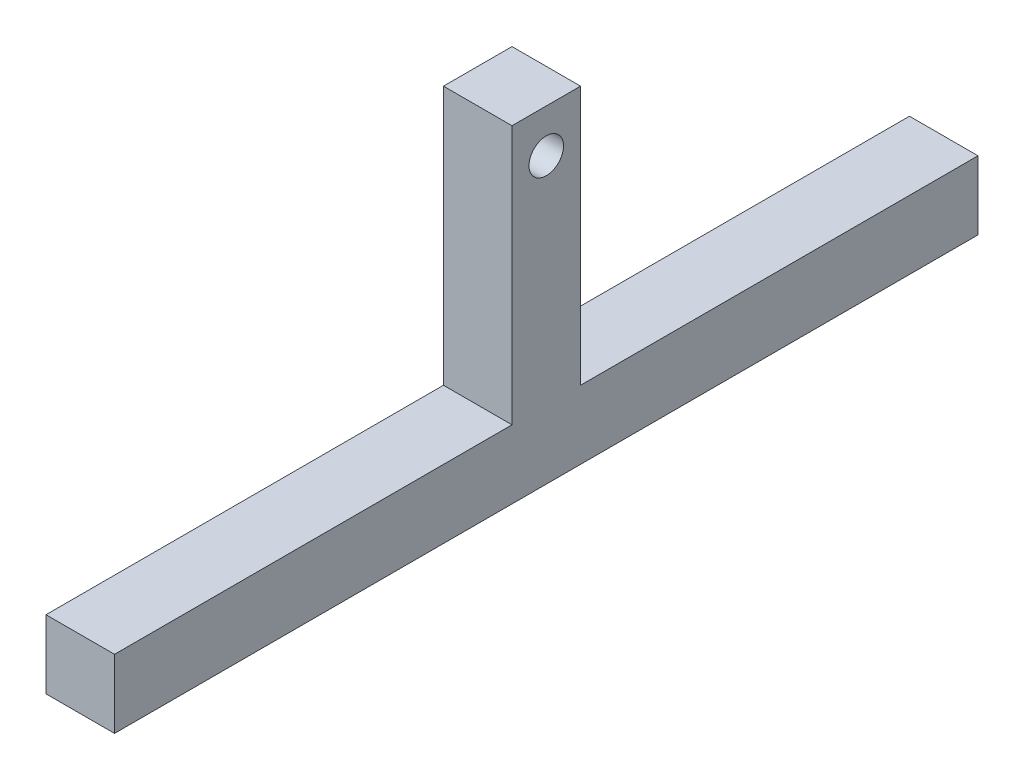
ISO-10303-21;
HEADER;
FILE_DESCRIPTION(('STEP AP214'),'2;1');
FILE_NAME('part.step','',(''),(''),'','','');
FILE_SCHEMA(('AUTOMOTIVE_DESIGN { 1 0 10303 214 1 1 1 1 }'));
ENDSEC;
DATA;
#1=APPLICATION_CONTEXT('core data for automotive mechanical design processes');
#2=APPLICATION_PROTOCOL_DEFINITION('international standard','automotive_design',2000,#1);
#3=PRODUCT_CONTEXT('',#1,'mechanical');
#4=PRODUCT('Part','Part','',(#3));
#5=PRODUCT_RELATED_PRODUCT_CATEGORY('part','',(#4));
#6=PRODUCT_DEFINITION_FORMATION('','',#4);
#7=PRODUCT_DEFINITION_CONTEXT('part definition',#1,'design');
#8=PRODUCT_DEFINITION('design','',#6,#7);
#9=PRODUCT_DEFINITION_SHAPE('','',#8);
#10=(LENGTH_UNIT() NAMED_UNIT(*) SI_UNIT(.MILLI.,.METRE.));
#11=(NAMED_UNIT(*) PLANE_ANGLE_UNIT() SI_UNIT($,.RADIAN.));
#12=(NAMED_UNIT(*) SI_UNIT($,.STERADIAN.) SOLID_ANGLE_UNIT());
#13=UNCERTAINTY_MEASURE_WITH_UNIT(LENGTH_MEASURE(1.E-05),#10,'distance_accuracy_value','');
#14=(GEOMETRIC_REPRESENTATION_CONTEXT(3) GLOBAL_UNCERTAINTY_ASSIGNED_CONTEXT((#13)) GLOBAL_UNIT_ASSIGNED_CONTEXT((#10,
#11,#12)) REPRESENTATION_CONTEXT('',''));
#15=CARTESIAN_POINT('',(0.,0.,0.));
#16=DIRECTION('',(0.,0.,1.));
#17=DIRECTION('',(1.,0.,0.));
#18=AXIS2_PLACEMENT_3D('',#15,#16,#17);
#19=CARTESIAN_POINT('',(15.875,0.,-100.));
#20=DIRECTION('',(0.,0.,-1.));
#21=DIRECTION('',(-1.,0.,0.));
#22=AXIS2_PLACEMENT_3D('',#19,#20,#21);
#23=PLANE('',#22);
#24=DIRECTION('',(0.,-1.,0.));
#25=VECTOR('',#24,1.);
#26=CARTESIAN_POINT('',(0.,0.,-100.));
#27=LINE('',#26,#25);
#28=CARTESIAN_POINT('',(0.,7.9375,-100.));
#29=VERTEX_POINT('',#28);
#30=CARTESIAN_POINT('',(0.,-7.9375,-100.));
#31=VERTEX_POINT('',#30);
#32=EDGE_CURVE('E159',#29,#31,#27,.T.);
#33=ORIENTED_EDGE('',*,*,#32,.F.);
#34=DIRECTION('',(-1.,0.,0.));
#35=VECTOR('',#34,1.);
#36=CARTESIAN_POINT('',(15.875,7.9375,-100.));
#37=LINE('',#36,#35);
#38=CARTESIAN_POINT('',(15.875,7.9375,-100.));
#39=VERTEX_POINT('',#38);
#40=EDGE_CURVE('E11',#39,#29,#37,.T.);
#41=ORIENTED_EDGE('',*,*,#40,.F.);
#42=DIRECTION('',(0.,-1.,0.));
#43=VECTOR('',#42,1.);
#44=CARTESIAN_POINT('',(15.875,0.,-100.));
#45=LINE('',#44,#43);
#46=CARTESIAN_POINT('',(15.875,-7.9375,-100.));
#47=VERTEX_POINT('',#46);
#48=EDGE_CURVE('E143',#39,#47,#45,.T.);
#49=ORIENTED_EDGE('',*,*,#48,.T.);
#50=DIRECTION('',(-1.,0.,0.));
#51=VECTOR('',#50,1.);
#52=CARTESIAN_POINT('',(15.875,-7.9375,-100.));
#53=LINE('',#52,#51);
#54=EDGE_CURVE('E92',#47,#31,#53,.T.);
#55=ORIENTED_EDGE('',*,*,#54,.T.);
#56=EDGE_LOOP('',(#33,#41,#49,#55));
#57=FACE_BOUND('',#56,.T.);
#58=ADVANCED_FACE('F41',(#57),#23,.T.);
#59=CARTESIAN_POINT('',(15.875,7.9375,0.));
#60=DIRECTION('',(0.,1.,0.));
#61=DIRECTION('',(0.,0.,1.));
#62=AXIS2_PLACEMENT_3D('',#59,#60,#61);
#63=PLANE('',#62);
#64=DIRECTION('',(0.,0.,-1.));
#65=VECTOR('',#64,1.);
#66=CARTESIAN_POINT('',(0.,7.9375,0.));
#67=LINE('',#66,#65);
#68=CARTESIAN_POINT('',(0.,7.9375,-7.9375));
#69=VERTEX_POINT('',#68);
#70=EDGE_CURVE('E164',#69,#29,#67,.T.);
#71=ORIENTED_EDGE('',*,*,#70,.F.);
#72=DIRECTION('',(-1.,0.,0.));
#73=VECTOR('',#72,1.);
#74=CARTESIAN_POINT('',(15.875,7.9375,-7.9375));
#75=LINE('',#74,#73);
#76=CARTESIAN_POINT('',(15.875,7.9375,-7.9375));
#77=VERTEX_POINT('',#76);
#78=EDGE_CURVE('E50',#77,#69,#75,.T.);
#79=ORIENTED_EDGE('',*,*,#78,.F.);
#80=DIRECTION('',(0.,0.,-1.));
#81=VECTOR('',#80,1.);
#82=CARTESIAN_POINT('',(15.875,7.9375,0.));
#83=LINE('',#82,#81);
#84=EDGE_CURVE('E134',#77,#39,#83,.T.);
#85=ORIENTED_EDGE('',*,*,#84,.T.);
#86=ORIENTED_EDGE('',*,*,#40,.T.);
#87=EDGE_LOOP('',(#71,#79,#85,#86));
#88=FACE_BOUND('',#87,.T.);
#89=ADVANCED_FACE('F207',(#88),#63,.T.);
#90=CARTESIAN_POINT('',(15.875,0.,-7.9375));
#91=DIRECTION('',(0.,0.,1.));
#92=DIRECTION('',(1.,0.,0.));
#93=AXIS2_PLACEMENT_3D('',#90,#91,#92);
#94=PLANE('',#93);
#95=DIRECTION('',(0.,1.,0.));
#96=VECTOR('',#95,1.);
#97=CARTESIAN_POINT('',(0.,0.,-7.9375));
#98=LINE('',#97,#96);
#99=CARTESIAN_POINT('',(0.,67.9375,-7.9375));
#100=VERTEX_POINT('',#99);
#101=EDGE_CURVE('E170',#69,#100,#98,.T.);
#102=ORIENTED_EDGE('',*,*,#101,.T.);
#103=DIRECTION('',(-1.,0.,0.));
#104=VECTOR('',#103,1.);
#105=CARTESIAN_POINT('',(15.875,67.9375,-7.9375));
#106=LINE('',#105,#104);
#107=CARTESIAN_POINT('',(15.875,67.9375,-7.9375));
#108=VERTEX_POINT('',#107);
#109=EDGE_CURVE('E196',#108,#100,#106,.T.);
#110=ORIENTED_EDGE('',*,*,#109,.F.);
#111=DIRECTION('',(0.,1.,0.));
#112=VECTOR('',#111,1.);
#113=CARTESIAN_POINT('',(15.875,0.,-7.9375));
#114=LINE('',#113,#112);
#115=EDGE_CURVE('E142',#77,#108,#114,.T.);
#116=ORIENTED_EDGE('',*,*,#115,.F.);
#117=ORIENTED_EDGE('',*,*,#78,.T.);
#118=EDGE_LOOP('',(#102,#110,#116,#117));
#119=FACE_BOUND('',#118,.T.);
#120=ADVANCED_FACE('F202',(#119),#94,.F.);
#121=CARTESIAN_POINT('',(15.875,67.9375,0.));
#122=DIRECTION('',(0.,1.,0.));
#123=DIRECTION('',(0.,0.,1.));
#124=AXIS2_PLACEMENT_3D('',#121,#122,#123);
#125=PLANE('',#124);
#126=DIRECTION('',(0.,0.,-1.));
#127=VECTOR('',#126,1.);
#128=CARTESIAN_POINT('',(0.,67.9375,0.));
#129=LINE('',#128,#127);
#130=CARTESIAN_POINT('',(0.,67.9375,7.9375));
#131=VERTEX_POINT('',#130);
#132=EDGE_CURVE('E177',#131,#100,#129,.T.);
#133=ORIENTED_EDGE('',*,*,#132,.F.);
#134=DIRECTION('',(-1.,0.,0.));
#135=VECTOR('',#134,1.);
#136=CARTESIAN_POINT('',(15.875,67.9375,7.9375));
#137=LINE('',#136,#135);
#138=CARTESIAN_POINT('',(15.875,67.9375,7.9375));
#139=VERTEX_POINT('',#138);
#140=EDGE_CURVE('E193',#139,#131,#137,.T.);
#141=ORIENTED_EDGE('',*,*,#140,.F.);
#142=DIRECTION('',(0.,0.,-1.));
#143=VECTOR('',#142,1.);
#144=CARTESIAN_POINT('',(15.875,67.9375,0.));
#145=LINE('',#144,#143);
#146=EDGE_CURVE('E136',#139,#108,#145,.T.);
#147=ORIENTED_EDGE('',*,*,#146,.T.);
#148=ORIENTED_EDGE('',*,*,#109,.T.);
#149=EDGE_LOOP('',(#133,#141,#147,#148));
#150=FACE_BOUND('',#149,.T.);
#151=ADVANCED_FACE('F216',(#150),#125,.T.);
#152=CARTESIAN_POINT('',(15.875,0.,7.9375));
#153=DIRECTION('',(0.,0.,1.));
#154=DIRECTION('',(1.,0.,0.));
#155=AXIS2_PLACEMENT_3D('',#152,#153,#154);
#156=PLANE('',#155);
#157=DIRECTION('',(0.,1.,0.));
#158=VECTOR('',#157,1.);
#159=CARTESIAN_POINT('',(0.,0.,7.9375));
#160=LINE('',#159,#158);
#161=CARTESIAN_POINT('',(0.,7.9375,7.9375));
#162=VERTEX_POINT('',#161);
#163=EDGE_CURVE('E181',#162,#131,#160,.T.);
#164=ORIENTED_EDGE('',*,*,#163,.F.);
#165=DIRECTION('',(-1.,0.,0.));
#166=VECTOR('',#165,1.);
#167=CARTESIAN_POINT('',(15.875,7.9375,7.9375));
#168=LINE('',#167,#166);
#169=CARTESIAN_POINT('',(15.875,7.9375,7.9375));
#170=VERTEX_POINT('',#169);
#171=EDGE_CURVE('E120',#170,#162,#168,.T.);
#172=ORIENTED_EDGE('',*,*,#171,.F.);
#173=DIRECTION('',(0.,1.,0.));
#174=VECTOR('',#173,1.);
#175=CARTESIAN_POINT('',(15.875,0.,7.9375));
#176=LINE('',#175,#174);
#177=EDGE_CURVE('E131',#170,#139,#176,.T.);
#178=ORIENTED_EDGE('',*,*,#177,.T.);
#179=ORIENTED_EDGE('',*,*,#140,.T.);
#180=EDGE_LOOP('',(#164,#172,#178,#179));
#181=FACE_BOUND('',#180,.T.);
#182=ADVANCED_FACE('F220',(#181),#156,.T.);
#183=CARTESIAN_POINT('',(0.,7.9375,100.));
#184=VERTEX_POINT('',#183);
#185=EDGE_CURVE('E118',#184,#162,#67,.T.);
#186=ORIENTED_EDGE('',*,*,#185,.F.);
#187=DIRECTION('',(-1.,0.,0.));
#188=VECTOR('',#187,1.);
#189=CARTESIAN_POINT('',(15.875,7.9375,100.));
#190=LINE('',#189,#188);
#191=CARTESIAN_POINT('',(15.875,7.9375,100.));
#192=VERTEX_POINT('',#191);
#193=EDGE_CURVE('E112',#192,#184,#190,.T.);
#194=ORIENTED_EDGE('',*,*,#193,.F.);
#195=EDGE_CURVE('E116',#192,#170,#83,.T.);
#196=ORIENTED_EDGE('',*,*,#195,.T.);
#197=ORIENTED_EDGE('',*,*,#171,.T.);
#198=EDGE_LOOP('',(#186,#194,#196,#197));
#199=FACE_BOUND('',#198,.T.);
#200=ADVANCED_FACE('F114',(#199),#63,.T.);
#201=CARTESIAN_POINT('',(15.875,0.,100.));
#202=DIRECTION('',(0.,0.,-1.));
#203=DIRECTION('',(-1.,0.,0.));
#204=AXIS2_PLACEMENT_3D('',#201,#202,#203);
#205=PLANE('',#204);
#206=DIRECTION('',(0.,-1.,0.));
#207=VECTOR('',#206,1.);
#208=CARTESIAN_POINT('',(0.,0.,100.));
#209=LINE('',#208,#207);
#210=CARTESIAN_POINT('',(0.,-7.9375,100.));
#211=VERTEX_POINT('',#210);
#212=EDGE_CURVE('E85',#184,#211,#209,.T.);
#213=ORIENTED_EDGE('',*,*,#212,.T.);
#214=DIRECTION('',(-1.,0.,0.));
#215=VECTOR('',#214,1.);
#216=CARTESIAN_POINT('',(15.875,-7.9375,100.));
#217=LINE('',#216,#215);
#218=CARTESIAN_POINT('',(15.875,-7.9375,100.));
#219=VERTEX_POINT('',#218);
#220=EDGE_CURVE('E121',#219,#211,#217,.T.);
#221=ORIENTED_EDGE('',*,*,#220,.F.);
#222=DIRECTION('',(0.,-1.,0.));
#223=VECTOR('',#222,1.);
#224=CARTESIAN_POINT('',(15.875,0.,100.));
#225=LINE('',#224,#223);
#226=EDGE_CURVE('E123',#192,#219,#225,.T.);
#227=ORIENTED_EDGE('',*,*,#226,.F.);
#228=ORIENTED_EDGE('',*,*,#193,.T.);
#229=EDGE_LOOP('',(#213,#221,#227,#228));
#230=FACE_BOUND('',#229,.T.);
#231=ADVANCED_FACE('F124',(#230),#205,.F.);
#232=CARTESIAN_POINT('',(15.875,-7.9375,0.));
#233=DIRECTION('',(0.,1.,0.));
#234=DIRECTION('',(0.,0.,1.));
#235=AXIS2_PLACEMENT_3D('',#232,#233,#234);
#236=PLANE('',#235);
#237=DIRECTION('',(0.,0.,-1.));
#238=VECTOR('',#237,1.);
#239=CARTESIAN_POINT('',(0.,-7.9375,0.));
#240=LINE('',#239,#238);
#241=EDGE_CURVE('E148',#211,#31,#240,.T.);
#242=ORIENTED_EDGE('',*,*,#241,.T.);
#243=ORIENTED_EDGE('',*,*,#54,.F.);
#244=DIRECTION('',(0.,0.,-1.));
#245=VECTOR('',#244,1.);
#246=CARTESIAN_POINT('',(15.875,-7.9375,0.));
#247=LINE('',#246,#245);
#248=EDGE_CURVE('E58',#219,#47,#247,.T.);
#249=ORIENTED_EDGE('',*,*,#248,.F.);
#250=ORIENTED_EDGE('',*,*,#220,.T.);
#251=EDGE_LOOP('',(#242,#243,#249,#250));
#252=FACE_BOUND('',#251,.T.);
#253=ADVANCED_FACE('F225',(#252),#236,.F.);
#254=CARTESIAN_POINT('',(15.875,0.,0.));
#255=DIRECTION('',(1.,0.,0.));
#256=DIRECTION('',(0.,0.,-1.));
#257=AXIS2_PLACEMENT_3D('',#254,#255,#256);
#258=PLANE('',#257);
#259=CARTESIAN_POINT('',(15.875,57.9375,0.));
#260=DIRECTION('',(1.,0.,0.));
#261=DIRECTION('',(0.,0.,-1.));
#262=AXIS2_PLACEMENT_3D('',#259,#260,#261);
#263=CIRCLE('',#262,4.);
#264=CARTESIAN_POINT('',(15.875,57.9375,-4.));
#265=VERTEX_POINT('',#264);
#266=EDGE_CURVE('E152',#265,#265,#263,.T.);
#267=ORIENTED_EDGE('',*,*,#266,.F.);
#268=EDGE_LOOP('',(#267));
#269=FACE_BOUND('',#268,.T.);
#270=ORIENTED_EDGE('',*,*,#48,.F.);
#271=ORIENTED_EDGE('',*,*,#84,.F.);
#272=ORIENTED_EDGE('',*,*,#115,.T.);
#273=ORIENTED_EDGE('',*,*,#146,.F.);
#274=ORIENTED_EDGE('',*,*,#177,.F.);
#275=ORIENTED_EDGE('',*,*,#195,.F.);
#276=ORIENTED_EDGE('',*,*,#226,.T.);
#277=ORIENTED_EDGE('',*,*,#248,.T.);
#278=EDGE_LOOP('',(#270,#271,#272,#273,#274,#275,#276,#277));
#279=FACE_BOUND('',#278,.T.);
#280=ADVANCED_FACE('F128',(#269,#279),#258,.T.);
#281=CARTESIAN_POINT('',(0.,0.,0.));
#282=DIRECTION('',(1.,0.,0.));
#283=DIRECTION('',(0.,0.,-1.));
#284=AXIS2_PLACEMENT_3D('',#281,#282,#283);
#285=PLANE('',#284);
#286=CARTESIAN_POINT('',(0.,57.9375,0.));
#287=DIRECTION('',(1.,0.,0.));
#288=DIRECTION('',(0.,0.,-1.));
#289=AXIS2_PLACEMENT_3D('',#286,#287,#288);
#290=CIRCLE('',#289,4.);
#291=CARTESIAN_POINT('',(0.,57.9375,-4.));
#292=VERTEX_POINT('',#291);
#293=EDGE_CURVE('E156',#292,#292,#290,.T.);
#294=ORIENTED_EDGE('',*,*,#293,.T.);
#295=EDGE_LOOP('',(#294));
#296=FACE_BOUND('',#295,.T.);
#297=ORIENTED_EDGE('',*,*,#32,.T.);
#298=ORIENTED_EDGE('',*,*,#241,.F.);
#299=ORIENTED_EDGE('',*,*,#212,.F.);
#300=ORIENTED_EDGE('',*,*,#185,.T.);
#301=ORIENTED_EDGE('',*,*,#163,.T.);
#302=ORIENTED_EDGE('',*,*,#132,.T.);
#303=ORIENTED_EDGE('',*,*,#101,.F.);
#304=ORIENTED_EDGE('',*,*,#70,.T.);
#305=EDGE_LOOP('',(#297,#298,#299,#300,#301,#302,#303,#304));
#306=FACE_BOUND('',#305,.T.);
#307=ADVANCED_FACE('F205',(#296,#306),#285,.F.);
#308=CARTESIAN_POINT('',(0.,57.9375,0.));
#309=DIRECTION('',(1.,0.,0.));
#310=DIRECTION('',(0.,0.,-1.));
#311=AXIS2_PLACEMENT_3D('',#308,#309,#310);
#312=CYLINDRICAL_SURFACE('',#311,4.);
#313=ORIENTED_EDGE('',*,*,#293,.F.);
#314=EDGE_LOOP('',(#313));
#315=FACE_BOUND('',#314,.T.);
#316=ORIENTED_EDGE('',*,*,#266,.T.);
#317=EDGE_LOOP('',(#316));
#318=FACE_BOUND('',#317,.T.);
#319=ADVANCED_FACE('F245',(#315,#318),#312,.F.);
#320=CLOSED_SHELL('',(#58,#89,#120,#151,#182,#200,#231,#253,#280,#307,#319));
#321=MANIFOLD_SOLID_BREP('B2',#320);
#322=ADVANCED_BREP_SHAPE_REPRESENTATION('',(#18,#321),#14);
#323=SHAPE_DEFINITION_REPRESENTATION(#9,#322);
ENDSEC;
END-ISO-10303-21;
